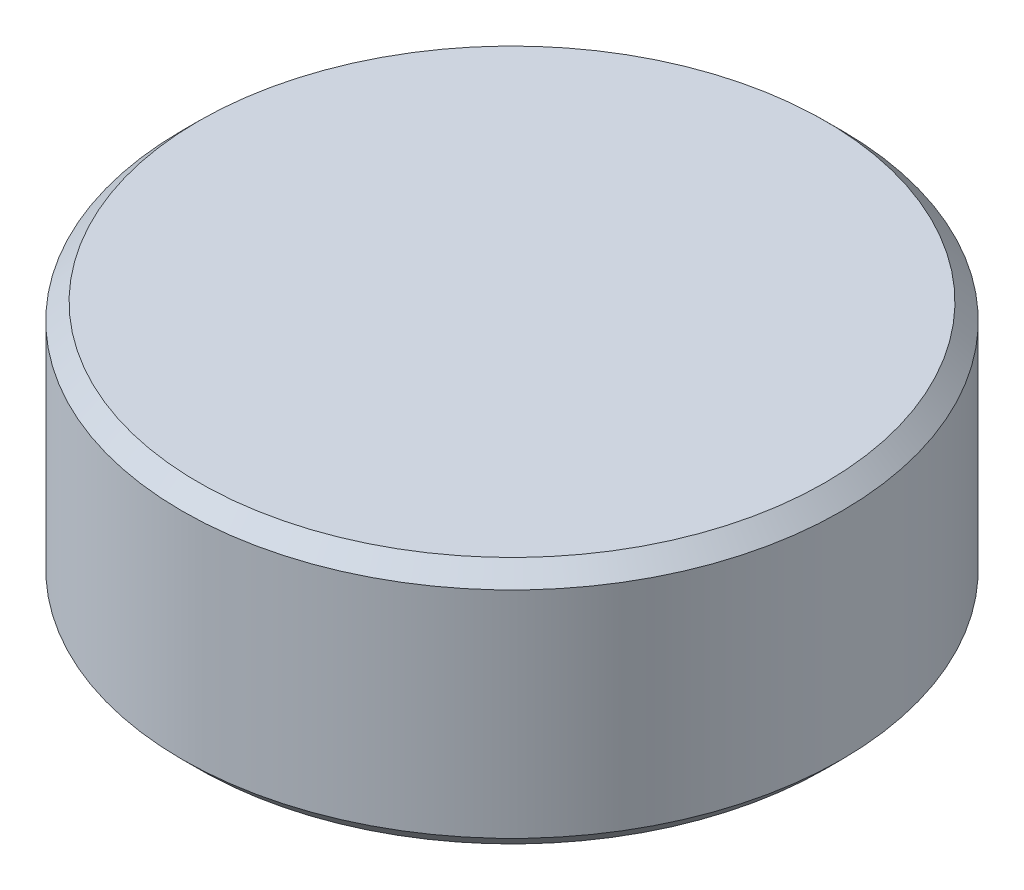
ISO-10303-21;
HEADER;
FILE_DESCRIPTION(('STEP AP214'),'2;1');
FILE_NAME('part.step','',(''),(''),'','','');
FILE_SCHEMA(('AUTOMOTIVE_DESIGN { 1 0 10303 214 1 1 1 1 }'));
ENDSEC;
DATA;
#1=APPLICATION_CONTEXT('core data for automotive mechanical design processes');
#2=APPLICATION_PROTOCOL_DEFINITION('international standard','automotive_design',2000,#1);
#3=PRODUCT_CONTEXT('',#1,'mechanical');
#4=PRODUCT('Part','Part','',(#3));
#5=PRODUCT_RELATED_PRODUCT_CATEGORY('part','',(#4));
#6=PRODUCT_DEFINITION_FORMATION('','',#4);
#7=PRODUCT_DEFINITION_CONTEXT('part definition',#1,'design');
#8=PRODUCT_DEFINITION('design','',#6,#7);
#9=PRODUCT_DEFINITION_SHAPE('','',#8);
#10=(LENGTH_UNIT() NAMED_UNIT(*) SI_UNIT(.MILLI.,.METRE.));
#11=(NAMED_UNIT(*) PLANE_ANGLE_UNIT() SI_UNIT($,.RADIAN.));
#12=(NAMED_UNIT(*) SI_UNIT($,.STERADIAN.) SOLID_ANGLE_UNIT());
#13=UNCERTAINTY_MEASURE_WITH_UNIT(LENGTH_MEASURE(1.E-05),#10,'distance_accuracy_value','');
#14=(GEOMETRIC_REPRESENTATION_CONTEXT(3) GLOBAL_UNCERTAINTY_ASSIGNED_CONTEXT((#13)) GLOBAL_UNIT_ASSIGNED_CONTEXT((#10,
#11,#12)) REPRESENTATION_CONTEXT('',''));
#15=CARTESIAN_POINT('',(0.,0.,0.));
#16=DIRECTION('',(0.,0.,1.));
#17=DIRECTION('',(1.,0.,0.));
#18=AXIS2_PLACEMENT_3D('',#15,#16,#17);
#19=CARTESIAN_POINT('',(0.,-18.125,705.55));
#20=DIRECTION('',(0.,-1.,0.));
#21=DIRECTION('',(0.,0.,1.));
#22=AXIS2_PLACEMENT_3D('',#19,#20,#21);
#23=PLANE('',#22);
#24=CARTESIAN_POINT('',(0.,-18.125,705.55));
#25=DIRECTION('',(0.,1.,0.));
#26=DIRECTION('',(1.,0.,0.));
#27=AXIS2_PLACEMENT_3D('',#24,#25,#26);
#28=CIRCLE('',#27,38.);
#29=CARTESIAN_POINT('',(38.,-18.125,705.55));
#30=VERTEX_POINT('',#29);
#31=EDGE_CURVE('E49',#30,#30,#28,.T.);
#32=ORIENTED_EDGE('',*,*,#31,.T.);
#33=EDGE_LOOP('',(#32));
#34=FACE_BOUND('',#33,.T.);
#35=ADVANCED_FACE('F17',(#34),#23,.F.);
#36=CARTESIAN_POINT('',(0.,-48.225,705.55));
#37=DIRECTION('',(0.,-1.,0.));
#38=DIRECTION('',(0.,0.,1.));
#39=AXIS2_PLACEMENT_3D('',#36,#37,#38);
#40=PLANE('',#39);
#41=CARTESIAN_POINT('',(0.,-48.225,705.55));
#42=DIRECTION('',(0.,-1.,0.));
#43=DIRECTION('',(1.,0.,0.));
#44=AXIS2_PLACEMENT_3D('',#41,#42,#43);
#45=CIRCLE('',#44,38.);
#46=CARTESIAN_POINT('',(-38.,-48.225,705.55));
#47=VERTEX_POINT('',#46);
#48=EDGE_CURVE('E28',#47,#47,#45,.T.);
#49=ORIENTED_EDGE('',*,*,#48,.T.);
#50=EDGE_LOOP('',(#49));
#51=FACE_BOUND('',#50,.T.);
#52=ADVANCED_FACE('F82',(#51),#40,.T.);
#53=CARTESIAN_POINT('',(0.,-48.225,705.55));
#54=DIRECTION('',(0.,1.,0.));
#55=DIRECTION('',(-1.,0.,0.));
#56=AXIS2_PLACEMENT_3D('',#53,#54,#55);
#57=CYLINDRICAL_SURFACE('',#56,40.);
#58=CARTESIAN_POINT('',(0.,-20.125,705.55));
#59=DIRECTION('',(0.,-1.,0.));
#60=DIRECTION('',(1.,0.,0.));
#61=AXIS2_PLACEMENT_3D('',#58,#59,#60);
#62=CIRCLE('',#61,40.);
#63=CARTESIAN_POINT('',(40.,-20.125,705.55));
#64=VERTEX_POINT('',#63);
#65=EDGE_CURVE('E21',#64,#64,#62,.T.);
#66=ORIENTED_EDGE('',*,*,#65,.T.);
#67=EDGE_LOOP('',(#66));
#68=FACE_BOUND('',#67,.T.);
#69=CARTESIAN_POINT('',(0.,-46.225,705.55));
#70=DIRECTION('',(0.,1.,0.));
#71=DIRECTION('',(1.,0.,0.));
#72=AXIS2_PLACEMENT_3D('',#69,#70,#71);
#73=CIRCLE('',#72,40.);
#74=CARTESIAN_POINT('',(-40.,-46.225,705.55));
#75=VERTEX_POINT('',#74);
#76=EDGE_CURVE('E11',#75,#75,#73,.T.);
#77=ORIENTED_EDGE('',*,*,#76,.T.);
#78=EDGE_LOOP('',(#77));
#79=FACE_BOUND('',#78,.T.);
#80=ADVANCED_FACE('F57',(#68,#79),#57,.T.);
#81=CARTESIAN_POINT('',(0.,-48.225,705.55));
#82=DIRECTION('',(0.,1.,0.));
#83=DIRECTION('',(-1.,0.,0.));
#84=AXIS2_PLACEMENT_3D('',#81,#82,#83);
#85=CONICAL_SURFACE('',#84,38.,0.785398163397448);
#86=ORIENTED_EDGE('',*,*,#76,.F.);
#87=EDGE_LOOP('',(#86));
#88=FACE_BOUND('',#87,.T.);
#89=ORIENTED_EDGE('',*,*,#48,.F.);
#90=EDGE_LOOP('',(#89));
#91=FACE_BOUND('',#90,.T.);
#92=ADVANCED_FACE('F19',(#88,#91),#85,.T.);
#93=CARTESIAN_POINT('',(0.,-20.125,705.55));
#94=DIRECTION('',(0.,-1.,0.));
#95=DIRECTION('',(1.,0.,0.));
#96=AXIS2_PLACEMENT_3D('',#93,#94,#95);
#97=CONICAL_SURFACE('',#96,40.,0.785398163397448);
#98=ORIENTED_EDGE('',*,*,#65,.F.);
#99=EDGE_LOOP('',(#98));
#100=FACE_BOUND('',#99,.T.);
#101=ORIENTED_EDGE('',*,*,#31,.F.);
#102=EDGE_LOOP('',(#101));
#103=FACE_BOUND('',#102,.T.);
#104=ADVANCED_FACE('F98',(#100,#103),#97,.T.);
#105=CLOSED_SHELL('',(#35,#52,#80,#92,#104));
#106=MANIFOLD_SOLID_BREP('B1',#105);
#107=ADVANCED_BREP_SHAPE_REPRESENTATION('',(#18,#106),#14);
#108=SHAPE_DEFINITION_REPRESENTATION(#9,#107);
ENDSEC;
END-ISO-10303-21;
